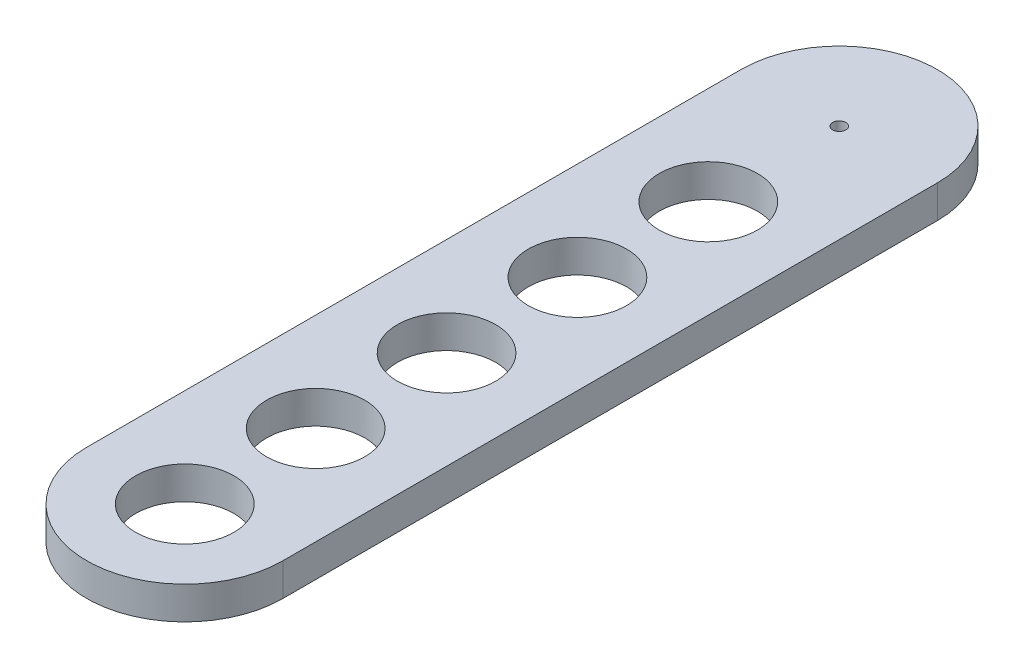
ISO-10303-21;
HEADER;
FILE_DESCRIPTION(('STEP AP214'),'2;1');
FILE_NAME('part.step','',(''),(''),'','','');
FILE_SCHEMA(('AUTOMOTIVE_DESIGN { 1 0 10303 214 1 1 1 1 }'));
ENDSEC;
DATA;
#1=APPLICATION_CONTEXT('core data for automotive mechanical design processes');
#2=APPLICATION_PROTOCOL_DEFINITION('international standard','automotive_design',2000,#1);
#3=PRODUCT_CONTEXT('',#1,'mechanical');
#4=PRODUCT('Part','Part','',(#3));
#5=PRODUCT_RELATED_PRODUCT_CATEGORY('part','',(#4));
#6=PRODUCT_DEFINITION_FORMATION('','',#4);
#7=PRODUCT_DEFINITION_CONTEXT('part definition',#1,'design');
#8=PRODUCT_DEFINITION('design','',#6,#7);
#9=PRODUCT_DEFINITION_SHAPE('','',#8);
#10=(LENGTH_UNIT() NAMED_UNIT(*) SI_UNIT(.MILLI.,.METRE.));
#11=(NAMED_UNIT(*) PLANE_ANGLE_UNIT() SI_UNIT($,.RADIAN.));
#12=(NAMED_UNIT(*) SI_UNIT($,.STERADIAN.) SOLID_ANGLE_UNIT());
#13=UNCERTAINTY_MEASURE_WITH_UNIT(LENGTH_MEASURE(1.E-05),#10,'distance_accuracy_value','');
#14=(GEOMETRIC_REPRESENTATION_CONTEXT(3) GLOBAL_UNCERTAINTY_ASSIGNED_CONTEXT((#13)) GLOBAL_UNIT_ASSIGNED_CONTEXT((#10,
#11,#12)) REPRESENTATION_CONTEXT('',''));
#15=CARTESIAN_POINT('',(0.,0.,0.));
#16=DIRECTION('',(0.,0.,1.));
#17=DIRECTION('',(1.,0.,0.));
#18=AXIS2_PLACEMENT_3D('',#15,#16,#17);
#19=CARTESIAN_POINT('',(0.,5.,0.));
#20=DIRECTION('',(0.,-1.,0.));
#21=DIRECTION('',(0.,0.,-1.));
#22=AXIS2_PLACEMENT_3D('',#19,#20,#21);
#23=PLANE('',#22);
#24=CARTESIAN_POINT('',(15.,5.,-35.));
#25=DIRECTION('',(0.,1.,0.));
#26=DIRECTION('',(0.,0.,1.));
#27=AXIS2_PLACEMENT_3D('',#24,#25,#26);
#28=CIRCLE('',#27,7.5);
#29=CARTESIAN_POINT('',(15.,5.,-27.5));
#30=VERTEX_POINT('',#29);
#31=EDGE_CURVE('E158',#30,#30,#28,.T.);
#32=ORIENTED_EDGE('',*,*,#31,.F.);
#33=EDGE_LOOP('',(#32));
#34=FACE_BOUND('',#33,.T.);
#35=CARTESIAN_POINT('',(15.,5.,-15.));
#36=DIRECTION('',(0.,1.,0.));
#37=DIRECTION('',(0.,0.,1.));
#38=AXIS2_PLACEMENT_3D('',#35,#36,#37);
#39=CIRCLE('',#38,7.5);
#40=CARTESIAN_POINT('',(15.,5.,-7.5));
#41=VERTEX_POINT('',#40);
#42=EDGE_CURVE('E84',#41,#41,#39,.T.);
#43=ORIENTED_EDGE('',*,*,#42,.F.);
#44=EDGE_LOOP('',(#43));
#45=FACE_BOUND('',#44,.T.);
#46=DIRECTION('',(0.,0.,-1.));
#47=VECTOR('',#46,1.);
#48=CARTESIAN_POINT('',(30.,5.,0.));
#49=LINE('',#48,#47);
#50=CARTESIAN_POINT('',(30.,5.,-15.));
#51=VERTEX_POINT('',#50);
#52=CARTESIAN_POINT('',(30.,5.,-115.));
#53=VERTEX_POINT('',#52);
#54=EDGE_CURVE('E116',#51,#53,#49,.T.);
#55=ORIENTED_EDGE('',*,*,#54,.T.);
#56=CARTESIAN_POINT('',(15.,5.,-115.));
#57=DIRECTION('',(0.,-1.,0.));
#58=DIRECTION('',(0.,0.,-1.));
#59=AXIS2_PLACEMENT_3D('',#56,#57,#58);
#60=CIRCLE('',#59,15.);
#61=CARTESIAN_POINT('',(0.,5.,-115.));
#62=VERTEX_POINT('',#61);
#63=EDGE_CURVE('E11',#53,#62,#60,.F.);
#64=ORIENTED_EDGE('',*,*,#63,.T.);
#65=DIRECTION('',(0.,0.,1.));
#66=VECTOR('',#65,1.);
#67=CARTESIAN_POINT('',(0.,5.,0.));
#68=LINE('',#67,#66);
#69=CARTESIAN_POINT('',(0.,5.,-15.));
#70=VERTEX_POINT('',#69);
#71=EDGE_CURVE('E114',#62,#70,#68,.T.);
#72=ORIENTED_EDGE('',*,*,#71,.T.);
#73=CARTESIAN_POINT('',(15.,5.,-15.));
#74=DIRECTION('',(0.,-1.,0.));
#75=DIRECTION('',(0.,0.,-1.));
#76=AXIS2_PLACEMENT_3D('',#73,#74,#75);
#77=CIRCLE('',#76,15.);
#78=EDGE_CURVE('E94',#70,#51,#77,.F.);
#79=ORIENTED_EDGE('',*,*,#78,.T.);
#80=EDGE_LOOP('',(#55,#64,#72,#79));
#81=FACE_BOUND('',#80,.T.);
#82=CARTESIAN_POINT('',(15.,5.,-55.));
#83=DIRECTION('',(0.,1.,0.));
#84=DIRECTION('',(0.,0.,1.));
#85=AXIS2_PLACEMENT_3D('',#82,#83,#84);
#86=CIRCLE('',#85,7.5);
#87=CARTESIAN_POINT('',(15.,5.,-47.5));
#88=VERTEX_POINT('',#87);
#89=EDGE_CURVE('E123',#88,#88,#86,.T.);
#90=ORIENTED_EDGE('',*,*,#89,.F.);
#91=EDGE_LOOP('',(#90));
#92=FACE_BOUND('',#91,.T.);
#93=CARTESIAN_POINT('',(15.,5.,-75.));
#94=DIRECTION('',(0.,1.,0.));
#95=DIRECTION('',(0.,0.,1.));
#96=AXIS2_PLACEMENT_3D('',#93,#94,#95);
#97=CIRCLE('',#96,7.5);
#98=CARTESIAN_POINT('',(15.,5.,-67.5));
#99=VERTEX_POINT('',#98);
#100=EDGE_CURVE('E129',#99,#99,#97,.T.);
#101=ORIENTED_EDGE('',*,*,#100,.F.);
#102=EDGE_LOOP('',(#101));
#103=FACE_BOUND('',#102,.T.);
#104=CARTESIAN_POINT('',(15.,5.,-95.));
#105=DIRECTION('',(0.,1.,0.));
#106=DIRECTION('',(0.,0.,1.));
#107=AXIS2_PLACEMENT_3D('',#104,#105,#106);
#108=CIRCLE('',#107,7.5);
#109=CARTESIAN_POINT('',(15.,5.,-87.5));
#110=VERTEX_POINT('',#109);
#111=EDGE_CURVE('E99',#110,#110,#108,.T.);
#112=ORIENTED_EDGE('',*,*,#111,.F.);
#113=EDGE_LOOP('',(#112));
#114=FACE_BOUND('',#113,.T.);
#115=CARTESIAN_POINT('',(15.,5.,-115.));
#116=DIRECTION('',(0.,1.,0.));
#117=DIRECTION('',(0.,0.,1.));
#118=AXIS2_PLACEMENT_3D('',#115,#116,#117);
#119=CIRCLE('',#118,1.);
#120=CARTESIAN_POINT('',(15.,5.,-114.));
#121=VERTEX_POINT('',#120);
#122=EDGE_CURVE('E148',#121,#121,#119,.T.);
#123=ORIENTED_EDGE('',*,*,#122,.F.);
#124=EDGE_LOOP('',(#123));
#125=FACE_BOUND('',#124,.T.);
#126=ADVANCED_FACE('F36',(#34,#45,#81,#92,#103,#114,#125),#23,.F.);
#127=CARTESIAN_POINT('',(15.,0.,-115.));
#128=DIRECTION('',(0.,-1.,0.));
#129=DIRECTION('',(0.,0.,-1.));
#130=AXIS2_PLACEMENT_3D('',#127,#128,#129);
#131=CYLINDRICAL_SURFACE('',#130,15.);
#132=DIRECTION('',(0.,-1.,0.));
#133=VECTOR('',#132,1.);
#134=CARTESIAN_POINT('',(30.,5.,-115.));
#135=LINE('',#134,#133);
#136=CARTESIAN_POINT('',(30.,0.,-115.));
#137=VERTEX_POINT('',#136);
#138=EDGE_CURVE('E108',#137,#53,#135,.F.);
#139=ORIENTED_EDGE('',*,*,#138,.F.);
#140=CARTESIAN_POINT('',(15.,0.,-115.));
#141=DIRECTION('',(0.,-1.,0.));
#142=DIRECTION('',(0.,0.,-1.));
#143=AXIS2_PLACEMENT_3D('',#140,#141,#142);
#144=CIRCLE('',#143,15.);
#145=CARTESIAN_POINT('',(0.,0.,-115.));
#146=VERTEX_POINT('',#145);
#147=EDGE_CURVE('E45',#146,#137,#144,.T.);
#148=ORIENTED_EDGE('',*,*,#147,.F.);
#149=DIRECTION('',(0.,-1.,0.));
#150=VECTOR('',#149,1.);
#151=CARTESIAN_POINT('',(0.,5.,-115.));
#152=LINE('',#151,#150);
#153=EDGE_CURVE('E81',#62,#146,#152,.T.);
#154=ORIENTED_EDGE('',*,*,#153,.F.);
#155=ORIENTED_EDGE('',*,*,#63,.F.);
#156=EDGE_LOOP('',(#139,#148,#154,#155));
#157=FACE_BOUND('',#156,.T.);
#158=ADVANCED_FACE('F39',(#157),#131,.T.);
#159=CARTESIAN_POINT('',(15.,0.,-15.));
#160=DIRECTION('',(0.,-1.,0.));
#161=DIRECTION('',(0.,0.,-1.));
#162=AXIS2_PLACEMENT_3D('',#159,#160,#161);
#163=CYLINDRICAL_SURFACE('',#162,15.);
#164=DIRECTION('',(0.,-1.,0.));
#165=VECTOR('',#164,1.);
#166=CARTESIAN_POINT('',(0.,5.,-15.));
#167=LINE('',#166,#165);
#168=CARTESIAN_POINT('',(0.,0.,-15.));
#169=VERTEX_POINT('',#168);
#170=EDGE_CURVE('E80',#169,#70,#167,.F.);
#171=ORIENTED_EDGE('',*,*,#170,.F.);
#172=CARTESIAN_POINT('',(15.,0.,-15.));
#173=DIRECTION('',(0.,-1.,0.));
#174=DIRECTION('',(0.,0.,-1.));
#175=AXIS2_PLACEMENT_3D('',#172,#173,#174);
#176=CIRCLE('',#175,15.);
#177=CARTESIAN_POINT('',(30.,0.,-15.));
#178=VERTEX_POINT('',#177);
#179=EDGE_CURVE('E87',#178,#169,#176,.T.);
#180=ORIENTED_EDGE('',*,*,#179,.F.);
#181=DIRECTION('',(0.,-1.,0.));
#182=VECTOR('',#181,1.);
#183=CARTESIAN_POINT('',(30.,5.,-15.));
#184=LINE('',#183,#182);
#185=EDGE_CURVE('E95',#51,#178,#184,.T.);
#186=ORIENTED_EDGE('',*,*,#185,.F.);
#187=ORIENTED_EDGE('',*,*,#78,.F.);
#188=EDGE_LOOP('',(#171,#180,#186,#187));
#189=FACE_BOUND('',#188,.T.);
#190=ADVANCED_FACE('F98',(#189),#163,.T.);
#191=CARTESIAN_POINT('',(15.,-0.00100000000000013,-95.));
#192=DIRECTION('',(0.,1.,0.));
#193=DIRECTION('',(0.,0.,1.));
#194=AXIS2_PLACEMENT_3D('',#191,#192,#193);
#195=CYLINDRICAL_SURFACE('',#194,7.5);
#196=CARTESIAN_POINT('',(15.,0.,-95.));
#197=DIRECTION('',(0.,-1.,0.));
#198=DIRECTION('',(0.,0.,-1.));
#199=AXIS2_PLACEMENT_3D('',#196,#197,#198);
#200=CIRCLE('',#199,7.5);
#201=CARTESIAN_POINT('',(15.,0.,-102.5));
#202=VERTEX_POINT('',#201);
#203=EDGE_CURVE('E103',#202,#202,#200,.F.);
#204=ORIENTED_EDGE('',*,*,#203,.F.);
#205=EDGE_LOOP('',(#204));
#206=FACE_BOUND('',#205,.T.);
#207=ORIENTED_EDGE('',*,*,#111,.T.);
#208=EDGE_LOOP('',(#207));
#209=FACE_BOUND('',#208,.T.);
#210=ADVANCED_FACE('F135',(#206,#209),#195,.F.);
#211=CARTESIAN_POINT('',(15.,-0.00100000000000013,-75.));
#212=DIRECTION('',(0.,1.,0.));
#213=DIRECTION('',(0.,0.,1.));
#214=AXIS2_PLACEMENT_3D('',#211,#212,#213);
#215=CYLINDRICAL_SURFACE('',#214,7.5);
#216=CARTESIAN_POINT('',(15.,0.,-75.));
#217=DIRECTION('',(0.,-1.,0.));
#218=DIRECTION('',(0.,0.,-1.));
#219=AXIS2_PLACEMENT_3D('',#216,#217,#218);
#220=CIRCLE('',#219,7.5);
#221=CARTESIAN_POINT('',(15.,0.,-82.5));
#222=VERTEX_POINT('',#221);
#223=EDGE_CURVE('E126',#222,#222,#220,.F.);
#224=ORIENTED_EDGE('',*,*,#223,.F.);
#225=EDGE_LOOP('',(#224));
#226=FACE_BOUND('',#225,.T.);
#227=ORIENTED_EDGE('',*,*,#100,.T.);
#228=EDGE_LOOP('',(#227));
#229=FACE_BOUND('',#228,.T.);
#230=ADVANCED_FACE('F138',(#226,#229),#215,.F.);
#231=CARTESIAN_POINT('',(15.,-0.00100000000000013,-55.));
#232=DIRECTION('',(0.,1.,0.));
#233=DIRECTION('',(0.,0.,1.));
#234=AXIS2_PLACEMENT_3D('',#231,#232,#233);
#235=CYLINDRICAL_SURFACE('',#234,7.5);
#236=CARTESIAN_POINT('',(15.,0.,-55.));
#237=DIRECTION('',(0.,-1.,0.));
#238=DIRECTION('',(0.,0.,-1.));
#239=AXIS2_PLACEMENT_3D('',#236,#237,#238);
#240=CIRCLE('',#239,7.5);
#241=CARTESIAN_POINT('',(15.,0.,-62.5));
#242=VERTEX_POINT('',#241);
#243=EDGE_CURVE('E120',#242,#242,#240,.F.);
#244=ORIENTED_EDGE('',*,*,#243,.F.);
#245=EDGE_LOOP('',(#244));
#246=FACE_BOUND('',#245,.T.);
#247=ORIENTED_EDGE('',*,*,#89,.T.);
#248=EDGE_LOOP('',(#247));
#249=FACE_BOUND('',#248,.T.);
#250=ADVANCED_FACE('F171',(#246,#249),#235,.F.);
#251=CARTESIAN_POINT('',(0.,5.,0.));
#252=DIRECTION('',(1.,0.,0.));
#253=DIRECTION('',(0.,0.,-1.));
#254=AXIS2_PLACEMENT_3D('',#251,#252,#253);
#255=PLANE('',#254);
#256=ORIENTED_EDGE('',*,*,#71,.F.);
#257=ORIENTED_EDGE('',*,*,#153,.T.);
#258=DIRECTION('',(0.,0.,1.));
#259=VECTOR('',#258,1.);
#260=CARTESIAN_POINT('',(0.,0.,0.));
#261=LINE('',#260,#259);
#262=EDGE_CURVE('E75',#146,#169,#261,.T.);
#263=ORIENTED_EDGE('',*,*,#262,.T.);
#264=ORIENTED_EDGE('',*,*,#170,.T.);
#265=EDGE_LOOP('',(#256,#257,#263,#264));
#266=FACE_BOUND('',#265,.T.);
#267=ADVANCED_FACE('F78',(#266),#255,.F.);
#268=CARTESIAN_POINT('',(30.,5.,0.));
#269=DIRECTION('',(-1.,0.,0.));
#270=DIRECTION('',(0.,0.,1.));
#271=AXIS2_PLACEMENT_3D('',#268,#269,#270);
#272=PLANE('',#271);
#273=DIRECTION('',(0.,0.,-1.));
#274=VECTOR('',#273,1.);
#275=CARTESIAN_POINT('',(30.,0.,0.));
#276=LINE('',#275,#274);
#277=EDGE_CURVE('E83',#178,#137,#276,.T.);
#278=ORIENTED_EDGE('',*,*,#277,.T.);
#279=ORIENTED_EDGE('',*,*,#138,.T.);
#280=ORIENTED_EDGE('',*,*,#54,.F.);
#281=ORIENTED_EDGE('',*,*,#185,.T.);
#282=EDGE_LOOP('',(#278,#279,#280,#281));
#283=FACE_BOUND('',#282,.T.);
#284=ADVANCED_FACE('F113',(#283),#272,.F.);
#285=CARTESIAN_POINT('',(0.,0.,0.));
#286=DIRECTION('',(0.,-1.,0.));
#287=DIRECTION('',(0.,0.,-1.));
#288=AXIS2_PLACEMENT_3D('',#285,#286,#287);
#289=PLANE('',#288);
#290=CARTESIAN_POINT('',(15.,0.,-115.));
#291=DIRECTION('',(0.,-1.,0.));
#292=DIRECTION('',(0.,0.,-1.));
#293=AXIS2_PLACEMENT_3D('',#290,#291,#292);
#294=CIRCLE('',#293,0.999999999999999);
#295=CARTESIAN_POINT('',(15.,0.,-116.));
#296=VERTEX_POINT('',#295);
#297=EDGE_CURVE('E150',#296,#296,#294,.T.);
#298=ORIENTED_EDGE('',*,*,#297,.F.);
#299=EDGE_LOOP('',(#298));
#300=FACE_BOUND('',#299,.T.);
#301=CARTESIAN_POINT('',(15.,0.,-35.));
#302=DIRECTION('',(0.,-1.,0.));
#303=DIRECTION('',(0.,0.,-1.));
#304=AXIS2_PLACEMENT_3D('',#301,#302,#303);
#305=CIRCLE('',#304,7.5);
#306=CARTESIAN_POINT('',(15.,0.,-42.5));
#307=VERTEX_POINT('',#306);
#308=EDGE_CURVE('E153',#307,#307,#305,.F.);
#309=ORIENTED_EDGE('',*,*,#308,.T.);
#310=EDGE_LOOP('',(#309));
#311=FACE_BOUND('',#310,.T.);
#312=CARTESIAN_POINT('',(15.,0.,-15.));
#313=DIRECTION('',(0.,-1.,0.));
#314=DIRECTION('',(0.,0.,-1.));
#315=AXIS2_PLACEMENT_3D('',#312,#313,#314);
#316=CIRCLE('',#315,7.5);
#317=CARTESIAN_POINT('',(15.,0.,-22.5));
#318=VERTEX_POINT('',#317);
#319=EDGE_CURVE('E161',#318,#318,#316,.F.);
#320=ORIENTED_EDGE('',*,*,#319,.T.);
#321=EDGE_LOOP('',(#320));
#322=FACE_BOUND('',#321,.T.);
#323=ORIENTED_EDGE('',*,*,#262,.F.);
#324=ORIENTED_EDGE('',*,*,#147,.T.);
#325=ORIENTED_EDGE('',*,*,#277,.F.);
#326=ORIENTED_EDGE('',*,*,#179,.T.);
#327=EDGE_LOOP('',(#323,#324,#325,#326));
#328=FACE_BOUND('',#327,.T.);
#329=ORIENTED_EDGE('',*,*,#243,.T.);
#330=EDGE_LOOP('',(#329));
#331=FACE_BOUND('',#330,.T.);
#332=ORIENTED_EDGE('',*,*,#223,.T.);
#333=EDGE_LOOP('',(#332));
#334=FACE_BOUND('',#333,.T.);
#335=ORIENTED_EDGE('',*,*,#203,.T.);
#336=EDGE_LOOP('',(#335));
#337=FACE_BOUND('',#336,.T.);
#338=ADVANCED_FACE('F88',(#300,#311,#322,#328,#331,#334,#337),#289,.T.);
#339=CARTESIAN_POINT('',(15.,-0.00100000000000013,-15.));
#340=DIRECTION('',(0.,1.,0.));
#341=DIRECTION('',(0.,0.,1.));
#342=AXIS2_PLACEMENT_3D('',#339,#340,#341);
#343=CYLINDRICAL_SURFACE('',#342,7.5);
#344=ORIENTED_EDGE('',*,*,#319,.F.);
#345=EDGE_LOOP('',(#344));
#346=FACE_BOUND('',#345,.T.);
#347=ORIENTED_EDGE('',*,*,#42,.T.);
#348=EDGE_LOOP('',(#347));
#349=FACE_BOUND('',#348,.T.);
#350=ADVANCED_FACE('F209',(#346,#349),#343,.F.);
#351=CARTESIAN_POINT('',(15.,-0.00100000000000013,-35.));
#352=DIRECTION('',(0.,1.,0.));
#353=DIRECTION('',(0.,0.,1.));
#354=AXIS2_PLACEMENT_3D('',#351,#352,#353);
#355=CYLINDRICAL_SURFACE('',#354,7.5);
#356=ORIENTED_EDGE('',*,*,#308,.F.);
#357=EDGE_LOOP('',(#356));
#358=FACE_BOUND('',#357,.T.);
#359=ORIENTED_EDGE('',*,*,#31,.T.);
#360=EDGE_LOOP('',(#359));
#361=FACE_BOUND('',#360,.T.);
#362=ADVANCED_FACE('F220',(#358,#361),#355,.F.);
#363=CARTESIAN_POINT('',(15.,5.,-115.));
#364=DIRECTION('',(0.,1.,0.));
#365=DIRECTION('',(0.,0.,1.));
#366=AXIS2_PLACEMENT_3D('',#363,#364,#365);
#367=CYLINDRICAL_SURFACE('',#366,0.999999999999999);
#368=ORIENTED_EDGE('',*,*,#122,.T.);
#369=EDGE_LOOP('',(#368));
#370=FACE_BOUND('',#369,.T.);
#371=ORIENTED_EDGE('',*,*,#297,.T.);
#372=EDGE_LOOP('',(#371));
#373=FACE_BOUND('',#372,.T.);
#374=ADVANCED_FACE('F217',(#370,#373),#367,.F.);
#375=CLOSED_SHELL('',(#126,#158,#190,#210,#230,#250,#267,#284,#338,#350,#362,#374));
#376=MANIFOLD_SOLID_BREP('B2',#375);
#377=ADVANCED_BREP_SHAPE_REPRESENTATION('',(#18,#376),#14);
#378=SHAPE_DEFINITION_REPRESENTATION(#9,#377);
ENDSEC;
END-ISO-10303-21;
